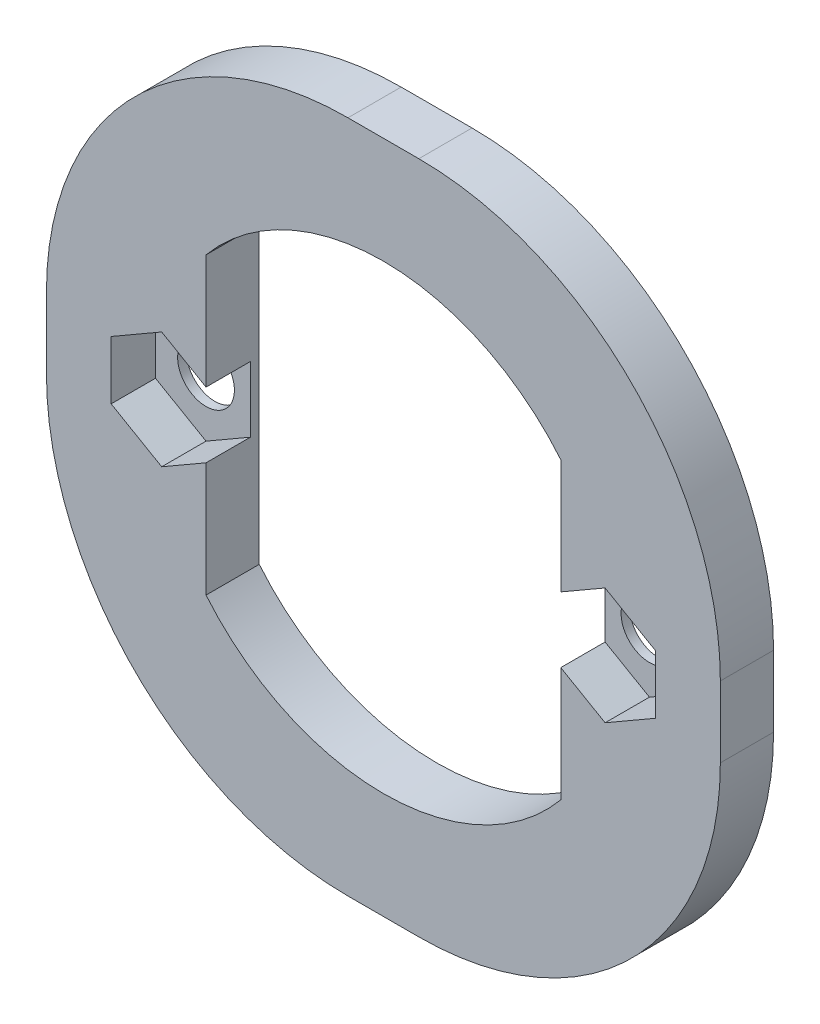
ISO-10303-21;
HEADER;
FILE_DESCRIPTION(('STEP AP214'),'2;1');
FILE_NAME('part.step','',(''),(''),'','','');
FILE_SCHEMA(('AUTOMOTIVE_DESIGN { 1 0 10303 214 1 1 1 1 }'));
ENDSEC;
DATA;
#1=APPLICATION_CONTEXT('core data for automotive mechanical design processes');
#2=APPLICATION_PROTOCOL_DEFINITION('international standard','automotive_design',2000,#1);
#3=PRODUCT_CONTEXT('',#1,'mechanical');
#4=PRODUCT('Part','Part','',(#3));
#5=PRODUCT_RELATED_PRODUCT_CATEGORY('part','',(#4));
#6=PRODUCT_DEFINITION_FORMATION('','',#4);
#7=PRODUCT_DEFINITION_CONTEXT('part definition',#1,'design');
#8=PRODUCT_DEFINITION('design','',#6,#7);
#9=PRODUCT_DEFINITION_SHAPE('','',#8);
#10=(LENGTH_UNIT() NAMED_UNIT(*) SI_UNIT(.MILLI.,.METRE.));
#11=(NAMED_UNIT(*) PLANE_ANGLE_UNIT() SI_UNIT($,.RADIAN.));
#12=(NAMED_UNIT(*) SI_UNIT($,.STERADIAN.) SOLID_ANGLE_UNIT());
#13=UNCERTAINTY_MEASURE_WITH_UNIT(LENGTH_MEASURE(1.E-05),#10,'distance_accuracy_value','');
#14=(GEOMETRIC_REPRESENTATION_CONTEXT(3) GLOBAL_UNCERTAINTY_ASSIGNED_CONTEXT((#13)) GLOBAL_UNIT_ASSIGNED_CONTEXT((#10,
#11,#12)) REPRESENTATION_CONTEXT('',''));
#15=CARTESIAN_POINT('',(0.,0.,0.));
#16=DIRECTION('',(0.,0.,1.));
#17=DIRECTION('',(1.,0.,0.));
#18=AXIS2_PLACEMENT_3D('',#15,#16,#17);
#19=CARTESIAN_POINT('',(12.5,0.,0.));
#20=DIRECTION('',(0.,0.,1.));
#21=DIRECTION('',(1.,0.,0.));
#22=AXIS2_PLACEMENT_3D('',#19,#20,#21);
#23=CYLINDRICAL_SURFACE('',#22,1.6);
#24=CARTESIAN_POINT('',(12.5,0.,0.));
#25=DIRECTION('',(0.,0.,1.));
#26=DIRECTION('',(1.,0.,0.));
#27=AXIS2_PLACEMENT_3D('',#24,#25,#26);
#28=CIRCLE('',#27,1.6);
#29=CARTESIAN_POINT('',(14.1,0.,0.));
#30=VERTEX_POINT('',#29);
#31=EDGE_CURVE('E338',#30,#30,#28,.T.);
#32=ORIENTED_EDGE('',*,*,#31,.F.);
#33=EDGE_LOOP('',(#32));
#34=FACE_BOUND('',#33,.T.);
#35=CARTESIAN_POINT('',(12.5,0.,0.5));
#36=DIRECTION('',(0.,0.,1.));
#37=DIRECTION('',(1.,0.,0.));
#38=AXIS2_PLACEMENT_3D('',#35,#36,#37);
#39=CIRCLE('',#38,1.6);
#40=CARTESIAN_POINT('',(14.1,0.,0.5));
#41=VERTEX_POINT('',#40);
#42=EDGE_CURVE('E52',#41,#41,#39,.F.);
#43=ORIENTED_EDGE('',*,*,#42,.F.);
#44=EDGE_LOOP('',(#43));
#45=FACE_BOUND('',#44,.T.);
#46=ADVANCED_FACE('F48',(#34,#45),#23,.F.);
#47=CARTESIAN_POINT('',(-12.5,0.,0.));
#48=DIRECTION('',(0.,0.,1.));
#49=DIRECTION('',(1.,0.,0.));
#50=AXIS2_PLACEMENT_3D('',#47,#48,#49);
#51=CYLINDRICAL_SURFACE('',#50,1.6);
#52=CARTESIAN_POINT('',(-12.5,0.,0.));
#53=DIRECTION('',(0.,0.,1.));
#54=DIRECTION('',(1.,0.,0.));
#55=AXIS2_PLACEMENT_3D('',#52,#53,#54);
#56=CIRCLE('',#55,1.6);
#57=CARTESIAN_POINT('',(-10.9,0.,0.));
#58=VERTEX_POINT('',#57);
#59=EDGE_CURVE('E339',#58,#58,#56,.T.);
#60=ORIENTED_EDGE('',*,*,#59,.F.);
#61=EDGE_LOOP('',(#60));
#62=FACE_BOUND('',#61,.T.);
#63=CARTESIAN_POINT('',(-12.5,0.,0.5));
#64=DIRECTION('',(0.,0.,1.));
#65=DIRECTION('',(1.,0.,0.));
#66=AXIS2_PLACEMENT_3D('',#63,#64,#65);
#67=CIRCLE('',#66,1.6);
#68=CARTESIAN_POINT('',(-10.9,0.,0.5));
#69=VERTEX_POINT('',#68);
#70=EDGE_CURVE('E265',#69,#69,#67,.F.);
#71=ORIENTED_EDGE('',*,*,#70,.F.);
#72=EDGE_LOOP('',(#71));
#73=FACE_BOUND('',#72,.T.);
#74=ADVANCED_FACE('F477',(#62,#73),#51,.F.);
#75=CARTESIAN_POINT('',(0.,0.,3.));
#76=DIRECTION('',(0.,0.,-1.));
#77=DIRECTION('',(-1.,0.,0.));
#78=AXIS2_PLACEMENT_3D('',#75,#76,#77);
#79=CYLINDRICAL_SURFACE('',#78,13.);
#80=CARTESIAN_POINT('',(0.,0.,0.));
#81=DIRECTION('',(0.,0.,1.));
#82=DIRECTION('',(1.,0.,0.));
#83=AXIS2_PLACEMENT_3D('',#80,#81,#82);
#84=CIRCLE('',#83,13.);
#85=CARTESIAN_POINT('',(10.,8.30662386291807,0.));
#86=VERTEX_POINT('',#85);
#87=CARTESIAN_POINT('',(-10.,8.30662386291808,0.));
#88=VERTEX_POINT('',#87);
#89=EDGE_CURVE('E425',#86,#88,#84,.T.);
#90=ORIENTED_EDGE('',*,*,#89,.F.);
#91=DIRECTION('',(0.,0.,-1.));
#92=VECTOR('',#91,1.);
#93=CARTESIAN_POINT('',(10.,8.30662386291807,3.));
#94=LINE('',#93,#92);
#95=CARTESIAN_POINT('',(10.,8.30662386291807,3.));
#96=VERTEX_POINT('',#95);
#97=EDGE_CURVE('E11',#96,#86,#94,.T.);
#98=ORIENTED_EDGE('',*,*,#97,.F.);
#99=CARTESIAN_POINT('',(0.,0.,3.));
#100=DIRECTION('',(0.,0.,1.));
#101=DIRECTION('',(1.,0.,0.));
#102=AXIS2_PLACEMENT_3D('',#99,#100,#101);
#103=CIRCLE('',#102,13.);
#104=CARTESIAN_POINT('',(-10.,8.30662386291808,3.));
#105=VERTEX_POINT('',#104);
#106=EDGE_CURVE('E377',#96,#105,#103,.T.);
#107=ORIENTED_EDGE('',*,*,#106,.T.);
#108=DIRECTION('',(0.,0.,-1.));
#109=VECTOR('',#108,1.);
#110=CARTESIAN_POINT('',(-10.,8.30662386291808,3.));
#111=LINE('',#110,#109);
#112=EDGE_CURVE('E440',#105,#88,#111,.T.);
#113=ORIENTED_EDGE('',*,*,#112,.T.);
#114=EDGE_LOOP('',(#90,#98,#107,#113));
#115=FACE_BOUND('',#114,.T.);
#116=ADVANCED_FACE('F479',(#115),#79,.F.);
#117=CARTESIAN_POINT('',(10.,0.,3.));
#118=DIRECTION('',(-1.,0.,0.));
#119=DIRECTION('',(0.,0.,1.));
#120=AXIS2_PLACEMENT_3D('',#117,#118,#119);
#121=PLANE('',#120);
#122=DIRECTION('',(0.,0.,1.));
#123=VECTOR('',#122,1.);
#124=CARTESIAN_POINT('',(10.,-1.84752086140681,3.));
#125=LINE('',#124,#123);
#126=CARTESIAN_POINT('',(10.,-1.84752086140681,0.5));
#127=VERTEX_POINT('',#126);
#128=CARTESIAN_POINT('',(10.,-1.84752086140681,3.));
#129=VERTEX_POINT('',#128);
#130=EDGE_CURVE('E328',#127,#129,#125,.T.);
#131=ORIENTED_EDGE('',*,*,#130,.F.);
#132=DIRECTION('',(0.,1.,0.));
#133=VECTOR('',#132,1.);
#134=CARTESIAN_POINT('',(10.,0.,0.5));
#135=LINE('',#134,#133);
#136=CARTESIAN_POINT('',(10.,1.8475208614068,0.5));
#137=VERTEX_POINT('',#136);
#138=EDGE_CURVE('E321',#127,#137,#135,.T.);
#139=ORIENTED_EDGE('',*,*,#138,.T.);
#140=DIRECTION('',(0.,0.,-1.));
#141=VECTOR('',#140,1.);
#142=CARTESIAN_POINT('',(10.,1.8475208614068,3.));
#143=LINE('',#142,#141);
#144=CARTESIAN_POINT('',(10.,1.8475208614068,3.));
#145=VERTEX_POINT('',#144);
#146=EDGE_CURVE('E325',#145,#137,#143,.T.);
#147=ORIENTED_EDGE('',*,*,#146,.F.);
#148=DIRECTION('',(0.,1.,0.));
#149=VECTOR('',#148,1.);
#150=CARTESIAN_POINT('',(10.,0.,3.));
#151=LINE('',#150,#149);
#152=EDGE_CURVE('E381',#145,#96,#151,.T.);
#153=ORIENTED_EDGE('',*,*,#152,.T.);
#154=ORIENTED_EDGE('',*,*,#97,.T.);
#155=DIRECTION('',(0.,1.,0.));
#156=VECTOR('',#155,1.);
#157=CARTESIAN_POINT('',(10.,0.,0.));
#158=LINE('',#157,#156);
#159=CARTESIAN_POINT('',(10.,-8.30662386291807,0.));
#160=VERTEX_POINT('',#159);
#161=EDGE_CURVE('E429',#160,#86,#158,.T.);
#162=ORIENTED_EDGE('',*,*,#161,.F.);
#163=DIRECTION('',(0.,0.,-1.));
#164=VECTOR('',#163,1.);
#165=CARTESIAN_POINT('',(10.,-8.30662386291807,3.));
#166=LINE('',#165,#164);
#167=CARTESIAN_POINT('',(10.,-8.30662386291807,3.));
#168=VERTEX_POINT('',#167);
#169=EDGE_CURVE('E58',#168,#160,#166,.T.);
#170=ORIENTED_EDGE('',*,*,#169,.F.);
#171=EDGE_CURVE('E382',#168,#129,#151,.T.);
#172=ORIENTED_EDGE('',*,*,#171,.T.);
#173=EDGE_LOOP('',(#131,#139,#147,#153,#154,#162,#170,#172));
#174=FACE_BOUND('',#173,.T.);
#175=ADVANCED_FACE('F486',(#174),#121,.T.);
#176=CARTESIAN_POINT('',(0.,0.,3.));
#177=DIRECTION('',(0.,0.,-1.));
#178=DIRECTION('',(-1.,0.,0.));
#179=AXIS2_PLACEMENT_3D('',#176,#177,#178);
#180=CYLINDRICAL_SURFACE('',#179,13.);
#181=CARTESIAN_POINT('',(0.,0.,0.));
#182=DIRECTION('',(0.,0.,1.));
#183=DIRECTION('',(1.,0.,0.));
#184=AXIS2_PLACEMENT_3D('',#181,#182,#183);
#185=CIRCLE('',#184,13.);
#186=CARTESIAN_POINT('',(-10.,-8.30662386291808,0.));
#187=VERTEX_POINT('',#186);
#188=EDGE_CURVE('E433',#187,#160,#185,.T.);
#189=ORIENTED_EDGE('',*,*,#188,.F.);
#190=DIRECTION('',(0.,0.,-1.));
#191=VECTOR('',#190,1.);
#192=CARTESIAN_POINT('',(-10.,-8.30662386291808,3.));
#193=LINE('',#192,#191);
#194=CARTESIAN_POINT('',(-10.,-8.30662386291808,3.));
#195=VERTEX_POINT('',#194);
#196=EDGE_CURVE('E443',#195,#187,#193,.T.);
#197=ORIENTED_EDGE('',*,*,#196,.F.);
#198=CARTESIAN_POINT('',(0.,0.,3.));
#199=DIRECTION('',(0.,0.,1.));
#200=DIRECTION('',(1.,0.,0.));
#201=AXIS2_PLACEMENT_3D('',#198,#199,#200);
#202=CIRCLE('',#201,13.);
#203=EDGE_CURVE('E386',#195,#168,#202,.T.);
#204=ORIENTED_EDGE('',*,*,#203,.T.);
#205=ORIENTED_EDGE('',*,*,#169,.T.);
#206=EDGE_LOOP('',(#189,#197,#204,#205));
#207=FACE_BOUND('',#206,.T.);
#208=ADVANCED_FACE('F509',(#207),#180,.F.);
#209=CARTESIAN_POINT('',(-1.99789300051845,2.,3.));
#210=DIRECTION('',(0.,0.,-1.));
#211=DIRECTION('',(-1.,0.,0.));
#212=AXIS2_PLACEMENT_3D('',#209,#210,#211);
#213=CYLINDRICAL_SURFACE('',#212,17.);
#214=CARTESIAN_POINT('',(-1.99789300051845,2.,0.));
#215=DIRECTION('',(0.,0.,1.));
#216=DIRECTION('',(1.,0.,0.));
#217=AXIS2_PLACEMENT_3D('',#214,#215,#216);
#218=CIRCLE('',#217,17.);
#219=CARTESIAN_POINT('',(-18.9978930005184,1.99999999999988,0.));
#220=VERTEX_POINT('',#219);
#221=CARTESIAN_POINT('',(-1.99789300051833,19.,0.));
#222=VERTEX_POINT('',#221);
#223=EDGE_CURVE('E343',#220,#222,#218,.F.);
#224=ORIENTED_EDGE('',*,*,#223,.F.);
#225=DIRECTION('',(0.,0.,-1.));
#226=VECTOR('',#225,1.);
#227=CARTESIAN_POINT('',(-18.9978930005184,1.99999999999988,3.));
#228=LINE('',#227,#226);
#229=CARTESIAN_POINT('',(-18.9978930005184,1.99999999999988,3.));
#230=VERTEX_POINT('',#229);
#231=EDGE_CURVE('E444',#230,#220,#228,.T.);
#232=ORIENTED_EDGE('',*,*,#231,.F.);
#233=CARTESIAN_POINT('',(-1.99789300051845,2.,3.));
#234=DIRECTION('',(0.,0.,1.));
#235=DIRECTION('',(1.,0.,0.));
#236=AXIS2_PLACEMENT_3D('',#233,#234,#235);
#237=CIRCLE('',#236,17.);
#238=CARTESIAN_POINT('',(-1.99789300051833,19.,3.));
#239=VERTEX_POINT('',#238);
#240=EDGE_CURVE('E347',#230,#239,#237,.F.);
#241=ORIENTED_EDGE('',*,*,#240,.T.);
#242=DIRECTION('',(0.,0.,-1.));
#243=VECTOR('',#242,1.);
#244=CARTESIAN_POINT('',(-1.99789300051833,19.,3.));
#245=LINE('',#244,#243);
#246=EDGE_CURVE('E395',#239,#222,#245,.T.);
#247=ORIENTED_EDGE('',*,*,#246,.T.);
#248=EDGE_LOOP('',(#224,#232,#241,#247));
#249=FACE_BOUND('',#248,.T.);
#250=ADVANCED_FACE('F50',(#249),#213,.T.);
#251=CARTESIAN_POINT('',(-18.9978930005184,0.,3.));
#252=DIRECTION('',(-1.,0.,0.));
#253=DIRECTION('',(0.,0.,1.));
#254=AXIS2_PLACEMENT_3D('',#251,#252,#253);
#255=PLANE('',#254);
#256=DIRECTION('',(0.,1.,0.));
#257=VECTOR('',#256,1.);
#258=CARTESIAN_POINT('',(-18.9978930005184,0.,0.));
#259=LINE('',#258,#257);
#260=CARTESIAN_POINT('',(-18.9978930005184,-1.99999999999988,0.));
#261=VERTEX_POINT('',#260);
#262=EDGE_CURVE('E399',#261,#220,#259,.T.);
#263=ORIENTED_EDGE('',*,*,#262,.F.);
#264=DIRECTION('',(0.,0.,-1.));
#265=VECTOR('',#264,1.);
#266=CARTESIAN_POINT('',(-18.9978930005184,-1.99999999999988,3.));
#267=LINE('',#266,#265);
#268=CARTESIAN_POINT('',(-18.9978930005184,-1.99999999999988,3.));
#269=VERTEX_POINT('',#268);
#270=EDGE_CURVE('E468',#269,#261,#267,.T.);
#271=ORIENTED_EDGE('',*,*,#270,.F.);
#272=DIRECTION('',(0.,1.,0.));
#273=VECTOR('',#272,1.);
#274=CARTESIAN_POINT('',(-18.9978930005184,0.,3.));
#275=LINE('',#274,#273);
#276=EDGE_CURVE('E351',#269,#230,#275,.T.);
#277=ORIENTED_EDGE('',*,*,#276,.T.);
#278=ORIENTED_EDGE('',*,*,#231,.T.);
#279=EDGE_LOOP('',(#263,#271,#277,#278));
#280=FACE_BOUND('',#279,.T.);
#281=ADVANCED_FACE('F537',(#280),#255,.T.);
#282=CARTESIAN_POINT('',(-1.99789300051845,-2.,3.));
#283=DIRECTION('',(0.,0.,-1.));
#284=DIRECTION('',(-1.,0.,0.));
#285=AXIS2_PLACEMENT_3D('',#282,#283,#284);
#286=CYLINDRICAL_SURFACE('',#285,17.);
#287=CARTESIAN_POINT('',(-1.99789300051845,-2.,0.));
#288=DIRECTION('',(0.,0.,1.));
#289=DIRECTION('',(1.,0.,0.));
#290=AXIS2_PLACEMENT_3D('',#287,#288,#289);
#291=CIRCLE('',#290,17.);
#292=CARTESIAN_POINT('',(-1.99789300051833,-19.,0.));
#293=VERTEX_POINT('',#292);
#294=EDGE_CURVE('E403',#293,#261,#291,.F.);
#295=ORIENTED_EDGE('',*,*,#294,.F.);
#296=DIRECTION('',(0.,0.,-1.));
#297=VECTOR('',#296,1.);
#298=CARTESIAN_POINT('',(-1.99789300051833,-19.,3.));
#299=LINE('',#298,#297);
#300=CARTESIAN_POINT('',(-1.99789300051833,-19.,3.));
#301=VERTEX_POINT('',#300);
#302=EDGE_CURVE('E465',#301,#293,#299,.T.);
#303=ORIENTED_EDGE('',*,*,#302,.F.);
#304=CARTESIAN_POINT('',(-1.99789300051845,-2.,3.));
#305=DIRECTION('',(0.,0.,1.));
#306=DIRECTION('',(1.,0.,0.));
#307=AXIS2_PLACEMENT_3D('',#304,#305,#306);
#308=CIRCLE('',#307,17.);
#309=EDGE_CURVE('E356',#301,#269,#308,.F.);
#310=ORIENTED_EDGE('',*,*,#309,.T.);
#311=ORIENTED_EDGE('',*,*,#270,.T.);
#312=EDGE_LOOP('',(#295,#303,#310,#311));
#313=FACE_BOUND('',#312,.T.);
#314=ADVANCED_FACE('F534',(#313),#286,.T.);
#315=CARTESIAN_POINT('',(0.,-19.,3.));
#316=DIRECTION('',(0.,1.,0.));
#317=DIRECTION('',(0.,0.,1.));
#318=AXIS2_PLACEMENT_3D('',#315,#316,#317);
#319=PLANE('',#318);
#320=DIRECTION('',(1.,0.,0.));
#321=VECTOR('',#320,1.);
#322=CARTESIAN_POINT('',(0.,-19.,0.));
#323=LINE('',#322,#321);
#324=CARTESIAN_POINT('',(1.99789300051833,-19.,0.));
#325=VERTEX_POINT('',#324);
#326=EDGE_CURVE('E407',#293,#325,#323,.T.);
#327=ORIENTED_EDGE('',*,*,#326,.T.);
#328=DIRECTION('',(0.,0.,-1.));
#329=VECTOR('',#328,1.);
#330=CARTESIAN_POINT('',(1.99789300051833,-19.,3.));
#331=LINE('',#330,#329);
#332=CARTESIAN_POINT('',(1.99789300051833,-19.,3.));
#333=VERTEX_POINT('',#332);
#334=EDGE_CURVE('E461',#333,#325,#331,.T.);
#335=ORIENTED_EDGE('',*,*,#334,.F.);
#336=DIRECTION('',(1.,0.,0.));
#337=VECTOR('',#336,1.);
#338=CARTESIAN_POINT('',(0.,-19.,3.));
#339=LINE('',#338,#337);
#340=EDGE_CURVE('E360',#301,#333,#339,.T.);
#341=ORIENTED_EDGE('',*,*,#340,.F.);
#342=ORIENTED_EDGE('',*,*,#302,.T.);
#343=EDGE_LOOP('',(#327,#335,#341,#342));
#344=FACE_BOUND('',#343,.T.);
#345=ADVANCED_FACE('F530',(#344),#319,.F.);
#346=CARTESIAN_POINT('',(1.99789300051845,-2.,3.));
#347=DIRECTION('',(0.,0.,-1.));
#348=DIRECTION('',(-1.,0.,0.));
#349=AXIS2_PLACEMENT_3D('',#346,#347,#348);
#350=CYLINDRICAL_SURFACE('',#349,17.);
#351=CARTESIAN_POINT('',(1.99789300051845,-2.,0.));
#352=DIRECTION('',(0.,0.,1.));
#353=DIRECTION('',(1.,0.,0.));
#354=AXIS2_PLACEMENT_3D('',#351,#352,#353);
#355=CIRCLE('',#354,17.);
#356=CARTESIAN_POINT('',(18.9978930005184,-1.99999999999988,0.));
#357=VERTEX_POINT('',#356);
#358=EDGE_CURVE('E410',#325,#357,#355,.T.);
#359=ORIENTED_EDGE('',*,*,#358,.T.);
#360=DIRECTION('',(0.,0.,-1.));
#361=VECTOR('',#360,1.);
#362=CARTESIAN_POINT('',(18.9978930005184,-1.99999999999988,3.));
#363=LINE('',#362,#361);
#364=CARTESIAN_POINT('',(18.9978930005184,-1.99999999999988,3.));
#365=VERTEX_POINT('',#364);
#366=EDGE_CURVE('E457',#365,#357,#363,.T.);
#367=ORIENTED_EDGE('',*,*,#366,.F.);
#368=CARTESIAN_POINT('',(1.99789300051845,-2.,3.));
#369=DIRECTION('',(0.,0.,1.));
#370=DIRECTION('',(1.,0.,0.));
#371=AXIS2_PLACEMENT_3D('',#368,#369,#370);
#372=CIRCLE('',#371,17.);
#373=EDGE_CURVE('E363',#333,#365,#372,.T.);
#374=ORIENTED_EDGE('',*,*,#373,.F.);
#375=ORIENTED_EDGE('',*,*,#334,.T.);
#376=EDGE_LOOP('',(#359,#367,#374,#375));
#377=FACE_BOUND('',#376,.T.);
#378=ADVANCED_FACE('F526',(#377),#350,.T.);
#379=CARTESIAN_POINT('',(18.9978930005184,0.,3.));
#380=DIRECTION('',(-1.,0.,0.));
#381=DIRECTION('',(0.,0.,1.));
#382=AXIS2_PLACEMENT_3D('',#379,#380,#381);
#383=PLANE('',#382);
#384=DIRECTION('',(0.,1.,0.));
#385=VECTOR('',#384,1.);
#386=CARTESIAN_POINT('',(18.9978930005184,0.,0.));
#387=LINE('',#386,#385);
#388=CARTESIAN_POINT('',(18.9978930005184,1.99999999999988,0.));
#389=VERTEX_POINT('',#388);
#390=EDGE_CURVE('E413',#357,#389,#387,.T.);
#391=ORIENTED_EDGE('',*,*,#390,.T.);
#392=DIRECTION('',(0.,0.,-1.));
#393=VECTOR('',#392,1.);
#394=CARTESIAN_POINT('',(18.9978930005184,1.99999999999988,3.));
#395=LINE('',#394,#393);
#396=CARTESIAN_POINT('',(18.9978930005184,1.99999999999988,3.));
#397=VERTEX_POINT('',#396);
#398=EDGE_CURVE('E454',#397,#389,#395,.T.);
#399=ORIENTED_EDGE('',*,*,#398,.F.);
#400=DIRECTION('',(0.,1.,0.));
#401=VECTOR('',#400,1.);
#402=CARTESIAN_POINT('',(18.9978930005184,0.,3.));
#403=LINE('',#402,#401);
#404=EDGE_CURVE('E366',#365,#397,#403,.T.);
#405=ORIENTED_EDGE('',*,*,#404,.F.);
#406=ORIENTED_EDGE('',*,*,#366,.T.);
#407=EDGE_LOOP('',(#391,#399,#405,#406));
#408=FACE_BOUND('',#407,.T.);
#409=ADVANCED_FACE('F522',(#408),#383,.F.);
#410=CARTESIAN_POINT('',(1.99789300051845,2.,3.));
#411=DIRECTION('',(0.,0.,-1.));
#412=DIRECTION('',(-1.,0.,0.));
#413=AXIS2_PLACEMENT_3D('',#410,#411,#412);
#414=CYLINDRICAL_SURFACE('',#413,17.);
#415=CARTESIAN_POINT('',(1.99789300051845,2.,0.));
#416=DIRECTION('',(0.,0.,1.));
#417=DIRECTION('',(1.,0.,0.));
#418=AXIS2_PLACEMENT_3D('',#415,#416,#417);
#419=CIRCLE('',#418,17.);
#420=CARTESIAN_POINT('',(1.99789300051833,19.,0.));
#421=VERTEX_POINT('',#420);
#422=EDGE_CURVE('E417',#421,#389,#419,.F.);
#423=ORIENTED_EDGE('',*,*,#422,.F.);
#424=DIRECTION('',(0.,0.,-1.));
#425=VECTOR('',#424,1.);
#426=CARTESIAN_POINT('',(1.99789300051833,19.,3.));
#427=LINE('',#426,#425);
#428=CARTESIAN_POINT('',(1.99789300051833,19.,3.));
#429=VERTEX_POINT('',#428);
#430=EDGE_CURVE('E451',#429,#421,#427,.T.);
#431=ORIENTED_EDGE('',*,*,#430,.F.);
#432=CARTESIAN_POINT('',(1.99789300051845,2.,3.));
#433=DIRECTION('',(0.,0.,1.));
#434=DIRECTION('',(1.,0.,0.));
#435=AXIS2_PLACEMENT_3D('',#432,#433,#434);
#436=CIRCLE('',#435,17.);
#437=EDGE_CURVE('E369',#429,#397,#436,.F.);
#438=ORIENTED_EDGE('',*,*,#437,.T.);
#439=ORIENTED_EDGE('',*,*,#398,.T.);
#440=EDGE_LOOP('',(#423,#431,#438,#439));
#441=FACE_BOUND('',#440,.T.);
#442=ADVANCED_FACE('F518',(#441),#414,.T.);
#443=CARTESIAN_POINT('',(0.,19.,3.));
#444=DIRECTION('',(0.,1.,0.));
#445=DIRECTION('',(0.,0.,1.));
#446=AXIS2_PLACEMENT_3D('',#443,#444,#445);
#447=PLANE('',#446);
#448=DIRECTION('',(1.,0.,0.));
#449=VECTOR('',#448,1.);
#450=CARTESIAN_POINT('',(0.,19.,0.));
#451=LINE('',#450,#449);
#452=EDGE_CURVE('E421',#222,#421,#451,.T.);
#453=ORIENTED_EDGE('',*,*,#452,.F.);
#454=ORIENTED_EDGE('',*,*,#246,.F.);
#455=DIRECTION('',(1.,0.,0.));
#456=VECTOR('',#455,1.);
#457=CARTESIAN_POINT('',(0.,19.,3.));
#458=LINE('',#457,#456);
#459=EDGE_CURVE('E373',#239,#429,#458,.T.);
#460=ORIENTED_EDGE('',*,*,#459,.T.);
#461=ORIENTED_EDGE('',*,*,#430,.T.);
#462=EDGE_LOOP('',(#453,#454,#460,#461));
#463=FACE_BOUND('',#462,.T.);
#464=ADVANCED_FACE('F507',(#463),#447,.T.);
#465=CARTESIAN_POINT('',(-10.,0.,3.));
#466=DIRECTION('',(-1.,0.,0.));
#467=DIRECTION('',(0.,0.,1.));
#468=AXIS2_PLACEMENT_3D('',#465,#466,#467);
#469=PLANE('',#468);
#470=DIRECTION('',(0.,1.,0.));
#471=VECTOR('',#470,1.);
#472=CARTESIAN_POINT('',(-10.,0.,3.));
#473=LINE('',#472,#471);
#474=CARTESIAN_POINT('',(-10.,1.8475208614068,3.));
#475=VERTEX_POINT('',#474);
#476=EDGE_CURVE('E390',#475,#105,#473,.T.);
#477=ORIENTED_EDGE('',*,*,#476,.F.);
#478=DIRECTION('',(0.,0.,-1.));
#479=VECTOR('',#478,1.);
#480=CARTESIAN_POINT('',(-10.,1.8475208614068,3.));
#481=LINE('',#480,#479);
#482=CARTESIAN_POINT('',(-10.,1.8475208614068,0.5));
#483=VERTEX_POINT('',#482);
#484=EDGE_CURVE('E335',#475,#483,#481,.T.);
#485=ORIENTED_EDGE('',*,*,#484,.T.);
#486=DIRECTION('',(0.,1.,0.));
#487=VECTOR('',#486,1.);
#488=CARTESIAN_POINT('',(-10.,0.,0.5));
#489=LINE('',#488,#487);
#490=CARTESIAN_POINT('',(-10.,-1.84752086140681,0.5));
#491=VERTEX_POINT('',#490);
#492=EDGE_CURVE('E219',#491,#483,#489,.T.);
#493=ORIENTED_EDGE('',*,*,#492,.F.);
#494=DIRECTION('',(0.,0.,1.));
#495=VECTOR('',#494,1.);
#496=CARTESIAN_POINT('',(-10.,-1.84752086140681,3.));
#497=LINE('',#496,#495);
#498=CARTESIAN_POINT('',(-10.,-1.84752086140681,3.));
#499=VERTEX_POINT('',#498);
#500=EDGE_CURVE('E331',#491,#499,#497,.T.);
#501=ORIENTED_EDGE('',*,*,#500,.T.);
#502=EDGE_CURVE('E391',#195,#499,#473,.T.);
#503=ORIENTED_EDGE('',*,*,#502,.F.);
#504=ORIENTED_EDGE('',*,*,#196,.T.);
#505=DIRECTION('',(0.,1.,0.));
#506=VECTOR('',#505,1.);
#507=CARTESIAN_POINT('',(-10.,0.,0.));
#508=LINE('',#507,#506);
#509=EDGE_CURVE('E352',#187,#88,#508,.T.);
#510=ORIENTED_EDGE('',*,*,#509,.T.);
#511=ORIENTED_EDGE('',*,*,#112,.F.);
#512=EDGE_LOOP('',(#477,#485,#493,#501,#503,#504,#510,#511));
#513=FACE_BOUND('',#512,.T.);
#514=ADVANCED_FACE('F500',(#513),#469,.F.);
#515=CARTESIAN_POINT('',(0.,0.,3.));
#516=DIRECTION('',(0.,0.,1.));
#517=DIRECTION('',(1.,0.,0.));
#518=AXIS2_PLACEMENT_3D('',#515,#516,#517);
#519=PLANE('',#518);
#520=DIRECTION('',(-0.866025403784439,0.5,0.));
#521=VECTOR('',#520,1.);
#522=CARTESIAN_POINT('',(-9.65,1.64544826719043,3.));
#523=LINE('',#522,#521);
#524=CARTESIAN_POINT('',(-12.5,3.29089653438087,3.));
#525=VERTEX_POINT('',#524);
#526=EDGE_CURVE('E227',#475,#525,#523,.T.);
#527=ORIENTED_EDGE('',*,*,#526,.F.);
#528=ORIENTED_EDGE('',*,*,#476,.T.);
#529=ORIENTED_EDGE('',*,*,#106,.F.);
#530=ORIENTED_EDGE('',*,*,#152,.F.);
#531=DIRECTION('',(-0.866025403784439,-0.5,0.));
#532=VECTOR('',#531,1.);
#533=CARTESIAN_POINT('',(12.5,3.29089653438087,3.));
#534=LINE('',#533,#532);
#535=CARTESIAN_POINT('',(12.5,3.29089653438087,3.));
#536=VERTEX_POINT('',#535);
#537=EDGE_CURVE('E297',#536,#145,#534,.T.);
#538=ORIENTED_EDGE('',*,*,#537,.F.);
#539=DIRECTION('',(-0.866025403784439,0.5,0.));
#540=VECTOR('',#539,1.);
#541=CARTESIAN_POINT('',(15.35,1.64544826719044,3.));
#542=LINE('',#541,#540);
#543=CARTESIAN_POINT('',(15.35,1.64544826719044,3.));
#544=VERTEX_POINT('',#543);
#545=EDGE_CURVE('E74',#544,#536,#542,.T.);
#546=ORIENTED_EDGE('',*,*,#545,.F.);
#547=DIRECTION('',(0.,1.,0.));
#548=VECTOR('',#547,1.);
#549=CARTESIAN_POINT('',(15.35,-1.64544826719043,3.));
#550=LINE('',#549,#548);
#551=CARTESIAN_POINT('',(15.35,-1.64544826719043,3.));
#552=VERTEX_POINT('',#551);
#553=EDGE_CURVE('E285',#552,#544,#550,.T.);
#554=ORIENTED_EDGE('',*,*,#553,.F.);
#555=DIRECTION('',(0.866025403784439,0.5,0.));
#556=VECTOR('',#555,1.);
#557=CARTESIAN_POINT('',(12.5,-3.29089653438087,3.));
#558=LINE('',#557,#556);
#559=CARTESIAN_POINT('',(12.5,-3.29089653438087,3.));
#560=VERTEX_POINT('',#559);
#561=EDGE_CURVE('E289',#560,#552,#558,.T.);
#562=ORIENTED_EDGE('',*,*,#561,.F.);
#563=DIRECTION('',(0.866025403784439,-0.5,0.));
#564=VECTOR('',#563,1.);
#565=CARTESIAN_POINT('',(9.65,-1.64544826719044,3.));
#566=LINE('',#565,#564);
#567=EDGE_CURVE('E294',#129,#560,#566,.T.);
#568=ORIENTED_EDGE('',*,*,#567,.F.);
#569=ORIENTED_EDGE('',*,*,#171,.F.);
#570=ORIENTED_EDGE('',*,*,#203,.F.);
#571=ORIENTED_EDGE('',*,*,#502,.T.);
#572=DIRECTION('',(0.866025403784439,0.5,0.));
#573=VECTOR('',#572,1.);
#574=CARTESIAN_POINT('',(-12.5,-3.29089653438087,3.));
#575=LINE('',#574,#573);
#576=CARTESIAN_POINT('',(-12.5,-3.29089653438087,3.));
#577=VERTEX_POINT('',#576);
#578=EDGE_CURVE('E223',#577,#499,#575,.T.);
#579=ORIENTED_EDGE('',*,*,#578,.F.);
#580=DIRECTION('',(0.866025403784439,-0.5,0.));
#581=VECTOR('',#580,1.);
#582=CARTESIAN_POINT('',(-15.35,-1.64544826719043,3.));
#583=LINE('',#582,#581);
#584=CARTESIAN_POINT('',(-15.35,-1.64544826719043,3.));
#585=VERTEX_POINT('',#584);
#586=EDGE_CURVE('E256',#585,#577,#583,.T.);
#587=ORIENTED_EDGE('',*,*,#586,.F.);
#588=DIRECTION('',(0.,-1.,0.));
#589=VECTOR('',#588,1.);
#590=CARTESIAN_POINT('',(-15.35,1.64544826719043,3.));
#591=LINE('',#590,#589);
#592=CARTESIAN_POINT('',(-15.35,1.64544826719043,3.));
#593=VERTEX_POINT('',#592);
#594=EDGE_CURVE('E252',#593,#585,#591,.T.);
#595=ORIENTED_EDGE('',*,*,#594,.F.);
#596=DIRECTION('',(-0.866025403784439,-0.5,0.));
#597=VECTOR('',#596,1.);
#598=CARTESIAN_POINT('',(-12.5,3.29089653438087,3.));
#599=LINE('',#598,#597);
#600=EDGE_CURVE('E249',#525,#593,#599,.T.);
#601=ORIENTED_EDGE('',*,*,#600,.F.);
#602=EDGE_LOOP('',(#527,#528,#529,#530,#538,#546,#554,#562,#568,#569,#570,#571,#579,#587,#595,#601));
#603=FACE_BOUND('',#602,.T.);
#604=ORIENTED_EDGE('',*,*,#240,.F.);
#605=ORIENTED_EDGE('',*,*,#276,.F.);
#606=ORIENTED_EDGE('',*,*,#309,.F.);
#607=ORIENTED_EDGE('',*,*,#340,.T.);
#608=ORIENTED_EDGE('',*,*,#373,.T.);
#609=ORIENTED_EDGE('',*,*,#404,.T.);
#610=ORIENTED_EDGE('',*,*,#437,.F.);
#611=ORIENTED_EDGE('',*,*,#459,.F.);
#612=EDGE_LOOP('',(#604,#605,#606,#607,#608,#609,#610,#611));
#613=FACE_BOUND('',#612,.T.);
#614=ADVANCED_FACE('F496',(#603,#613),#519,.T.);
#615=CARTESIAN_POINT('',(0.,0.,0.));
#616=DIRECTION('',(0.,0.,1.));
#617=DIRECTION('',(1.,0.,0.));
#618=AXIS2_PLACEMENT_3D('',#615,#616,#617);
#619=PLANE('',#618);
#620=ORIENTED_EDGE('',*,*,#59,.T.);
#621=EDGE_LOOP('',(#620));
#622=FACE_BOUND('',#621,.T.);
#623=ORIENTED_EDGE('',*,*,#31,.T.);
#624=EDGE_LOOP('',(#623));
#625=FACE_BOUND('',#624,.T.);
#626=ORIENTED_EDGE('',*,*,#223,.T.);
#627=ORIENTED_EDGE('',*,*,#452,.T.);
#628=ORIENTED_EDGE('',*,*,#422,.T.);
#629=ORIENTED_EDGE('',*,*,#390,.F.);
#630=ORIENTED_EDGE('',*,*,#358,.F.);
#631=ORIENTED_EDGE('',*,*,#326,.F.);
#632=ORIENTED_EDGE('',*,*,#294,.T.);
#633=ORIENTED_EDGE('',*,*,#262,.T.);
#634=EDGE_LOOP('',(#626,#627,#628,#629,#630,#631,#632,#633));
#635=FACE_BOUND('',#634,.T.);
#636=ORIENTED_EDGE('',*,*,#89,.T.);
#637=ORIENTED_EDGE('',*,*,#509,.F.);
#638=ORIENTED_EDGE('',*,*,#188,.T.);
#639=ORIENTED_EDGE('',*,*,#161,.T.);
#640=EDGE_LOOP('',(#636,#637,#638,#639));
#641=FACE_BOUND('',#640,.T.);
#642=ADVANCED_FACE('F499',(#622,#625,#635,#641),#619,.F.);
#643=CARTESIAN_POINT('',(-9.65,1.64544826719043,0.5));
#644=DIRECTION('',(0.5,0.866025403784439,0.));
#645=DIRECTION('',(-0.866025403784439,0.5,0.));
#646=AXIS2_PLACEMENT_3D('',#643,#644,#645);
#647=PLANE('',#646);
#648=ORIENTED_EDGE('',*,*,#526,.T.);
#649=DIRECTION('',(0.,0.,1.));
#650=VECTOR('',#649,1.);
#651=CARTESIAN_POINT('',(-12.5,3.29089653438087,0.5));
#652=LINE('',#651,#650);
#653=CARTESIAN_POINT('',(-12.5,3.29089653438087,0.5));
#654=VERTEX_POINT('',#653);
#655=EDGE_CURVE('E66',#654,#525,#652,.T.);
#656=ORIENTED_EDGE('',*,*,#655,.F.);
#657=DIRECTION('',(-0.866025403784439,0.5,0.));
#658=VECTOR('',#657,1.);
#659=CARTESIAN_POINT('',(-9.65,1.64544826719043,0.5));
#660=LINE('',#659,#658);
#661=EDGE_CURVE('E213',#483,#654,#660,.T.);
#662=ORIENTED_EDGE('',*,*,#661,.F.);
#663=ORIENTED_EDGE('',*,*,#484,.F.);
#664=EDGE_LOOP('',(#648,#656,#662,#663));
#665=FACE_BOUND('',#664,.T.);
#666=ADVANCED_FACE('F225',(#665),#647,.F.);
#667=CARTESIAN_POINT('',(-12.5,-3.29089653438087,0.5));
#668=DIRECTION('',(0.5,-0.866025403784439,0.));
#669=DIRECTION('',(0.866025403784439,0.5,0.));
#670=AXIS2_PLACEMENT_3D('',#667,#668,#669);
#671=PLANE('',#670);
#672=DIRECTION('',(0.866025403784439,0.5,0.));
#673=VECTOR('',#672,1.);
#674=CARTESIAN_POINT('',(-12.5,-3.29089653438087,0.5));
#675=LINE('',#674,#673);
#676=CARTESIAN_POINT('',(-12.5,-3.29089653438087,0.5));
#677=VERTEX_POINT('',#676);
#678=EDGE_CURVE('E231',#677,#491,#675,.T.);
#679=ORIENTED_EDGE('',*,*,#678,.F.);
#680=DIRECTION('',(0.,0.,1.));
#681=VECTOR('',#680,1.);
#682=CARTESIAN_POINT('',(-12.5,-3.29089653438087,0.5));
#683=LINE('',#682,#681);
#684=EDGE_CURVE('E262',#677,#577,#683,.T.);
#685=ORIENTED_EDGE('',*,*,#684,.T.);
#686=ORIENTED_EDGE('',*,*,#578,.T.);
#687=ORIENTED_EDGE('',*,*,#500,.F.);
#688=EDGE_LOOP('',(#679,#685,#686,#687));
#689=FACE_BOUND('',#688,.T.);
#690=ADVANCED_FACE('F620',(#689),#671,.F.);
#691=CARTESIAN_POINT('',(0.,0.,0.5));
#692=DIRECTION('',(0.,0.,1.));
#693=DIRECTION('',(1.,0.,0.));
#694=AXIS2_PLACEMENT_3D('',#691,#692,#693);
#695=PLANE('',#694);
#696=ORIENTED_EDGE('',*,*,#70,.T.);
#697=EDGE_LOOP('',(#696));
#698=FACE_BOUND('',#697,.T.);
#699=ORIENTED_EDGE('',*,*,#492,.T.);
#700=ORIENTED_EDGE('',*,*,#661,.T.);
#701=DIRECTION('',(-0.866025403784439,-0.5,0.));
#702=VECTOR('',#701,1.);
#703=CARTESIAN_POINT('',(-12.5,3.29089653438087,0.5));
#704=LINE('',#703,#702);
#705=CARTESIAN_POINT('',(-15.35,1.64544826719043,0.5));
#706=VERTEX_POINT('',#705);
#707=EDGE_CURVE('E216',#654,#706,#704,.T.);
#708=ORIENTED_EDGE('',*,*,#707,.T.);
#709=DIRECTION('',(0.,-1.,0.));
#710=VECTOR('',#709,1.);
#711=CARTESIAN_POINT('',(-15.35,1.64544826719043,0.5));
#712=LINE('',#711,#710);
#713=CARTESIAN_POINT('',(-15.35,-1.64544826719043,0.5));
#714=VERTEX_POINT('',#713);
#715=EDGE_CURVE('E236',#706,#714,#712,.T.);
#716=ORIENTED_EDGE('',*,*,#715,.T.);
#717=DIRECTION('',(0.866025403784439,-0.5,0.));
#718=VECTOR('',#717,1.);
#719=CARTESIAN_POINT('',(-15.35,-1.64544826719043,0.5));
#720=LINE('',#719,#718);
#721=EDGE_CURVE('E239',#714,#677,#720,.T.);
#722=ORIENTED_EDGE('',*,*,#721,.T.);
#723=ORIENTED_EDGE('',*,*,#678,.T.);
#724=EDGE_LOOP('',(#699,#700,#708,#716,#722,#723));
#725=FACE_BOUND('',#724,.T.);
#726=ADVANCED_FACE('F214',(#698,#725),#695,.T.);
#727=CARTESIAN_POINT('',(-15.35,-1.64544826719043,0.5));
#728=DIRECTION('',(-0.5,-0.866025403784439,0.));
#729=DIRECTION('',(0.866025403784439,-0.5,0.));
#730=AXIS2_PLACEMENT_3D('',#727,#728,#729);
#731=PLANE('',#730);
#732=ORIENTED_EDGE('',*,*,#586,.T.);
#733=ORIENTED_EDGE('',*,*,#684,.F.);
#734=ORIENTED_EDGE('',*,*,#721,.F.);
#735=DIRECTION('',(0.,0.,1.));
#736=VECTOR('',#735,1.);
#737=CARTESIAN_POINT('',(-15.35,-1.64544826719043,0.5));
#738=LINE('',#737,#736);
#739=EDGE_CURVE('E266',#714,#585,#738,.T.);
#740=ORIENTED_EDGE('',*,*,#739,.T.);
#741=EDGE_LOOP('',(#732,#733,#734,#740));
#742=FACE_BOUND('',#741,.T.);
#743=ADVANCED_FACE('F624',(#742),#731,.F.);
#744=CARTESIAN_POINT('',(-15.35,1.64544826719043,0.5));
#745=DIRECTION('',(-1.,0.,0.));
#746=DIRECTION('',(0.,0.,1.));
#747=AXIS2_PLACEMENT_3D('',#744,#745,#746);
#748=PLANE('',#747);
#749=ORIENTED_EDGE('',*,*,#594,.T.);
#750=ORIENTED_EDGE('',*,*,#739,.F.);
#751=ORIENTED_EDGE('',*,*,#715,.F.);
#752=DIRECTION('',(0.,0.,1.));
#753=VECTOR('',#752,1.);
#754=CARTESIAN_POINT('',(-15.35,1.64544826719043,0.5));
#755=LINE('',#754,#753);
#756=EDGE_CURVE('E230',#706,#593,#755,.T.);
#757=ORIENTED_EDGE('',*,*,#756,.T.);
#758=EDGE_LOOP('',(#749,#750,#751,#757));
#759=FACE_BOUND('',#758,.T.);
#760=ADVANCED_FACE('F597',(#759),#748,.F.);
#761=CARTESIAN_POINT('',(-12.5,3.29089653438087,0.5));
#762=DIRECTION('',(-0.5,0.866025403784439,0.));
#763=DIRECTION('',(-0.866025403784439,-0.5,0.));
#764=AXIS2_PLACEMENT_3D('',#761,#762,#763);
#765=PLANE('',#764);
#766=ORIENTED_EDGE('',*,*,#600,.T.);
#767=ORIENTED_EDGE('',*,*,#756,.F.);
#768=ORIENTED_EDGE('',*,*,#707,.F.);
#769=ORIENTED_EDGE('',*,*,#655,.T.);
#770=EDGE_LOOP('',(#766,#767,#768,#769));
#771=FACE_BOUND('',#770,.T.);
#772=ADVANCED_FACE('F233',(#771),#765,.F.);
#773=CARTESIAN_POINT('',(0.,0.,0.5));
#774=DIRECTION('',(0.,0.,1.));
#775=DIRECTION('',(1.,0.,0.));
#776=AXIS2_PLACEMENT_3D('',#773,#774,#775);
#777=PLANE('',#776);
#778=DIRECTION('',(0.866025403784439,-0.5,0.));
#779=VECTOR('',#778,1.);
#780=CARTESIAN_POINT('',(9.65,-1.64544826719044,0.5));
#781=LINE('',#780,#779);
#782=CARTESIAN_POINT('',(12.5,-3.29089653438087,0.5));
#783=VERTEX_POINT('',#782);
#784=EDGE_CURVE('E309',#127,#783,#781,.T.);
#785=ORIENTED_EDGE('',*,*,#784,.T.);
#786=DIRECTION('',(0.866025403784439,0.5,0.));
#787=VECTOR('',#786,1.);
#788=CARTESIAN_POINT('',(12.5,-3.29089653438087,0.5));
#789=LINE('',#788,#787);
#790=CARTESIAN_POINT('',(15.35,-1.64544826719043,0.5));
#791=VERTEX_POINT('',#790);
#792=EDGE_CURVE('E305',#783,#791,#789,.T.);
#793=ORIENTED_EDGE('',*,*,#792,.T.);
#794=DIRECTION('',(0.,1.,0.));
#795=VECTOR('',#794,1.);
#796=CARTESIAN_POINT('',(15.35,-1.64544826719043,0.5));
#797=LINE('',#796,#795);
#798=CARTESIAN_POINT('',(15.35,1.64544826719044,0.5));
#799=VERTEX_POINT('',#798);
#800=EDGE_CURVE('E274',#791,#799,#797,.T.);
#801=ORIENTED_EDGE('',*,*,#800,.T.);
#802=DIRECTION('',(-0.866025403784439,0.5,0.));
#803=VECTOR('',#802,1.);
#804=CARTESIAN_POINT('',(15.35,1.64544826719044,0.5));
#805=LINE('',#804,#803);
#806=CARTESIAN_POINT('',(12.5,3.29089653438087,0.5));
#807=VERTEX_POINT('',#806);
#808=EDGE_CURVE('E290',#799,#807,#805,.T.);
#809=ORIENTED_EDGE('',*,*,#808,.T.);
#810=DIRECTION('',(-0.866025403784439,-0.5,0.));
#811=VECTOR('',#810,1.);
#812=CARTESIAN_POINT('',(12.5,3.29089653438087,0.5));
#813=LINE('',#812,#811);
#814=EDGE_CURVE('E312',#807,#137,#813,.T.);
#815=ORIENTED_EDGE('',*,*,#814,.T.);
#816=ORIENTED_EDGE('',*,*,#138,.F.);
#817=EDGE_LOOP('',(#785,#793,#801,#809,#815,#816));
#818=FACE_BOUND('',#817,.T.);
#819=ORIENTED_EDGE('',*,*,#42,.T.);
#820=EDGE_LOOP('',(#819));
#821=FACE_BOUND('',#820,.T.);
#822=ADVANCED_FACE('F493',(#818,#821),#777,.T.);
#823=CARTESIAN_POINT('',(15.35,1.64544826719044,0.5));
#824=DIRECTION('',(0.5,0.866025403784439,0.));
#825=DIRECTION('',(-0.866025403784439,0.5,0.));
#826=AXIS2_PLACEMENT_3D('',#823,#824,#825);
#827=PLANE('',#826);
#828=ORIENTED_EDGE('',*,*,#545,.T.);
#829=DIRECTION('',(0.,0.,1.));
#830=VECTOR('',#829,1.);
#831=CARTESIAN_POINT('',(12.5,3.29089653438087,0.5));
#832=LINE('',#831,#830);
#833=EDGE_CURVE('E271',#807,#536,#832,.T.);
#834=ORIENTED_EDGE('',*,*,#833,.F.);
#835=ORIENTED_EDGE('',*,*,#808,.F.);
#836=DIRECTION('',(0.,0.,1.));
#837=VECTOR('',#836,1.);
#838=CARTESIAN_POINT('',(15.35,1.64544826719044,0.5));
#839=LINE('',#838,#837);
#840=EDGE_CURVE('E282',#799,#544,#839,.T.);
#841=ORIENTED_EDGE('',*,*,#840,.T.);
#842=EDGE_LOOP('',(#828,#834,#835,#841));
#843=FACE_BOUND('',#842,.T.);
#844=ADVANCED_FACE('F589',(#843),#827,.F.);
#845=CARTESIAN_POINT('',(15.35,-1.64544826719043,0.5));
#846=DIRECTION('',(1.,0.,0.));
#847=DIRECTION('',(0.,1.,0.));
#848=AXIS2_PLACEMENT_3D('',#845,#846,#847);
#849=PLANE('',#848);
#850=ORIENTED_EDGE('',*,*,#553,.T.);
#851=ORIENTED_EDGE('',*,*,#840,.F.);
#852=ORIENTED_EDGE('',*,*,#800,.F.);
#853=DIRECTION('',(0.,0.,1.));
#854=VECTOR('',#853,1.);
#855=CARTESIAN_POINT('',(15.35,-1.64544826719043,0.5));
#856=LINE('',#855,#854);
#857=EDGE_CURVE('E279',#791,#552,#856,.T.);
#858=ORIENTED_EDGE('',*,*,#857,.T.);
#859=EDGE_LOOP('',(#850,#851,#852,#858));
#860=FACE_BOUND('',#859,.T.);
#861=ADVANCED_FACE('F595',(#860),#849,.F.);
#862=CARTESIAN_POINT('',(12.5,-3.29089653438087,0.5));
#863=DIRECTION('',(0.5,-0.866025403784439,0.));
#864=DIRECTION('',(0.866025403784439,0.5,0.));
#865=AXIS2_PLACEMENT_3D('',#862,#863,#864);
#866=PLANE('',#865);
#867=ORIENTED_EDGE('',*,*,#561,.T.);
#868=ORIENTED_EDGE('',*,*,#857,.F.);
#869=ORIENTED_EDGE('',*,*,#792,.F.);
#870=DIRECTION('',(0.,0.,1.));
#871=VECTOR('',#870,1.);
#872=CARTESIAN_POINT('',(12.5,-3.29089653438087,0.5));
#873=LINE('',#872,#871);
#874=EDGE_CURVE('E275',#783,#560,#873,.T.);
#875=ORIENTED_EDGE('',*,*,#874,.T.);
#876=EDGE_LOOP('',(#867,#868,#869,#875));
#877=FACE_BOUND('',#876,.T.);
#878=ADVANCED_FACE('F608',(#877),#866,.F.);
#879=CARTESIAN_POINT('',(9.65,-1.64544826719044,0.5));
#880=DIRECTION('',(-0.5,-0.866025403784439,0.));
#881=DIRECTION('',(0.866025403784439,-0.5,0.));
#882=AXIS2_PLACEMENT_3D('',#879,#880,#881);
#883=PLANE('',#882);
#884=ORIENTED_EDGE('',*,*,#130,.T.);
#885=ORIENTED_EDGE('',*,*,#567,.T.);
#886=ORIENTED_EDGE('',*,*,#874,.F.);
#887=ORIENTED_EDGE('',*,*,#784,.F.);
#888=EDGE_LOOP('',(#884,#885,#886,#887));
#889=FACE_BOUND('',#888,.T.);
#890=ADVANCED_FACE('F604',(#889),#883,.F.);
#891=CARTESIAN_POINT('',(12.5,3.29089653438087,0.5));
#892=DIRECTION('',(-0.5,0.866025403784439,0.));
#893=DIRECTION('',(-0.866025403784439,-0.5,0.));
#894=AXIS2_PLACEMENT_3D('',#891,#892,#893);
#895=PLANE('',#894);
#896=ORIENTED_EDGE('',*,*,#146,.T.);
#897=ORIENTED_EDGE('',*,*,#814,.F.);
#898=ORIENTED_EDGE('',*,*,#833,.T.);
#899=ORIENTED_EDGE('',*,*,#537,.T.);
#900=EDGE_LOOP('',(#896,#897,#898,#899));
#901=FACE_BOUND('',#900,.T.);
#902=ADVANCED_FACE('F614',(#901),#895,.F.);
#903=CLOSED_SHELL('',(#46,#74,#116,#175,#208,#250,#281,#314,#345,#378,#409,#442,#464,#514,#614,
#642,#666,#690,#726,#743,#760,#772,#822,#844,#861,#878,#890,#902));
#904=MANIFOLD_SOLID_BREP('B2',#903);
#905=ADVANCED_BREP_SHAPE_REPRESENTATION('',(#18,#904),#14);
#906=SHAPE_DEFINITION_REPRESENTATION(#9,#905);
ENDSEC;
END-ISO-10303-21;
